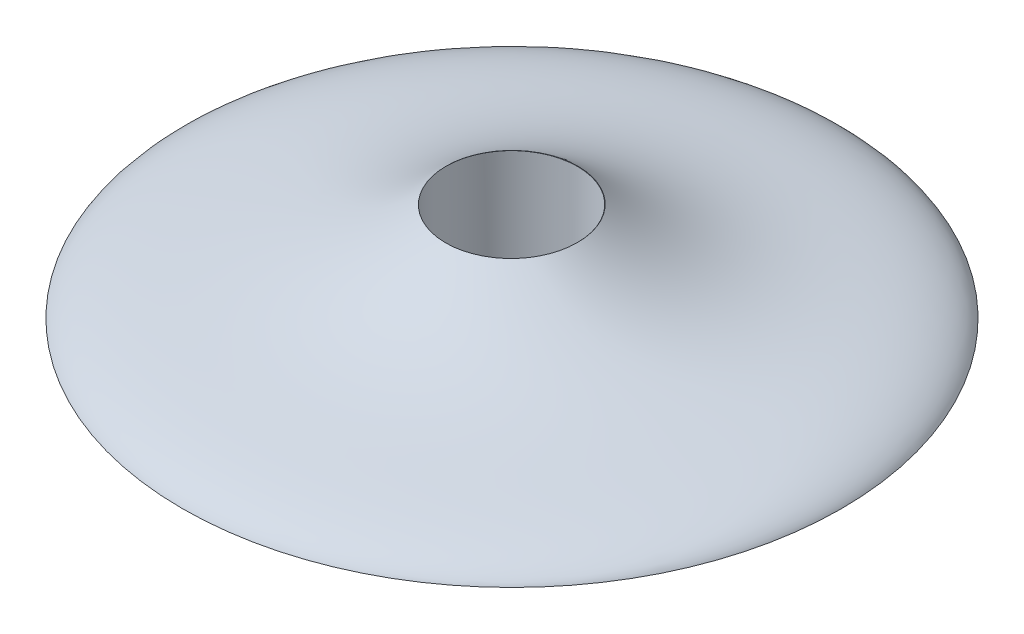
ISO-10303-21;
HEADER;
FILE_DESCRIPTION(('STEP AP214'),'2;1');
FILE_NAME('part.step','',(''),(''),'','','');
FILE_SCHEMA(('AUTOMOTIVE_DESIGN { 1 0 10303 214 1 1 1 1 }'));
ENDSEC;
DATA;
#1=APPLICATION_CONTEXT('core data for automotive mechanical design processes');
#2=APPLICATION_PROTOCOL_DEFINITION('international standard','automotive_design',2000,#1);
#3=PRODUCT_CONTEXT('',#1,'mechanical');
#4=PRODUCT('Part','Part','',(#3));
#5=PRODUCT_RELATED_PRODUCT_CATEGORY('part','',(#4));
#6=PRODUCT_DEFINITION_FORMATION('','',#4);
#7=PRODUCT_DEFINITION_CONTEXT('part definition',#1,'design');
#8=PRODUCT_DEFINITION('design','',#6,#7);
#9=PRODUCT_DEFINITION_SHAPE('','',#8);
#10=(LENGTH_UNIT() NAMED_UNIT(*) SI_UNIT(.MILLI.,.METRE.));
#11=(NAMED_UNIT(*) PLANE_ANGLE_UNIT() SI_UNIT($,.RADIAN.));
#12=(NAMED_UNIT(*) SI_UNIT($,.STERADIAN.) SOLID_ANGLE_UNIT());
#13=UNCERTAINTY_MEASURE_WITH_UNIT(LENGTH_MEASURE(1.E-05),#10,'distance_accuracy_value','');
#14=(GEOMETRIC_REPRESENTATION_CONTEXT(3) GLOBAL_UNCERTAINTY_ASSIGNED_CONTEXT((#13)) GLOBAL_UNIT_ASSIGNED_CONTEXT((#10,
#11,#12)) REPRESENTATION_CONTEXT('',''));
#15=CARTESIAN_POINT('',(0.,0.,0.));
#16=DIRECTION('',(0.,0.,1.));
#17=DIRECTION('',(1.,0.,0.));
#18=AXIS2_PLACEMENT_3D('',#15,#16,#17);
#19=CARTESIAN_POINT('',(0.,21.8997437807607,77.0266387212866));
#20=DIRECTION('',(0.,-1.,0.));
#21=DIRECTION('',(0.,0.,-1.));
#22=AXIS2_PLACEMENT_3D('',#19,#20,#21);
#23=PLANE('',#22);
#24=CARTESIAN_POINT('',(0.,21.8997437807607,77.0266387212866));
#25=DIRECTION('',(0.,1.,0.));
#26=DIRECTION('',(0.,0.,1.));
#27=AXIS2_PLACEMENT_3D('',#24,#25,#26);
#28=CIRCLE('',#27,20.);
#29=CARTESIAN_POINT('',(19.9999011276975,21.8997437807607,77.0895265764357));
#30=VERTEX_POINT('',#29);
#31=CARTESIAN_POINT('',(-19.9999011276975,21.8997437807607,77.0895265764357));
#32=VERTEX_POINT('',#31);
#33=EDGE_CURVE('E11',#30,#32,#28,.T.);
#34=ORIENTED_EDGE('',*,*,#33,.T.);
#35=CARTESIAN_POINT('',(0.,21.8997437807607,77.1524144315848));
#36=DIRECTION('',(0.,1.,0.));
#37=DIRECTION('',(0.,0.,1.));
#38=AXIS2_PLACEMENT_3D('',#35,#36,#37);
#39=CIRCLE('',#38,20.);
#40=EDGE_CURVE('E53',#30,#32,#39,.T.);
#41=ORIENTED_EDGE('',*,*,#40,.F.);
#42=EDGE_LOOP('',(#34,#41));
#43=FACE_BOUND('',#42,.T.);
#44=ADVANCED_FACE('F38',(#43),#23,.F.);
#45=CARTESIAN_POINT('',(0.,-8.10025621923931,-22.9733612787134));
#46=CARTESIAN_POINT('',(0.,-2.49334702214268,-19.9993093597715));
#47=CARTESIAN_POINT('',(0.,5.04834585964005,0.0220774557360062));
#48=CARTESIAN_POINT('',(0.,-4.11511832897066,26.4374090590696));
#49=CARTESIAN_POINT('',(0.,21.8997437807607,57.0266387212866));
#50=B_SPLINE_CURVE_WITH_KNOTS('',4,(#45,#46,#47,#48,#49),.UNSPECIFIED.,.F.,.F.,(5,5),(0.,1.),.UNSPECIFIED.);
#51=CARTESIAN_POINT('',(0.,21.8997437807607,77.0266387212866));
#52=DIRECTION('',(0.,1.,0.));
#53=AXIS1_PLACEMENT('',#51,#52);
#54=SURFACE_OF_REVOLUTION('',#50,#53);
#55=ORIENTED_EDGE('',*,*,#33,.F.);
#56=CARTESIAN_POINT('',(19.9999011276975,21.8997437807607,77.0895265764357));
#57=CARTESIAN_POINT('',(20.001092221049,21.8977381002619,77.4645352176946));
#58=CARTESIAN_POINT('',(19.9917125112781,21.8957328209817,77.8395757495852));
#59=CARTESIAN_POINT('',(19.9518944773006,21.8917294683275,78.5885196430176));
#60=CARTESIAN_POINT('',(19.9214571506898,21.8897313946167,78.9624230575871));
#61=CARTESIAN_POINT('',(19.8396076463942,21.8857486981624,79.7079213766596));
#62=CARTESIAN_POINT('',(19.7881958143085,21.8837640751978,80.0795163190969));
#63=CARTESIAN_POINT('',(19.6646075361611,21.8798158811614,80.8189691824129));
#64=CARTESIAN_POINT('',(19.5924455892104,21.8778522963795,81.1868295276564));
#65=CARTESIAN_POINT('',(19.4275679732304,21.8739509270405,81.9179164707618));
#66=CARTESIAN_POINT('',(19.3348525218015,21.8720131422105,82.2811431176377));
#67=CARTESIAN_POINT('',(19.1291714769108,21.868169561009,83.0017938624247));
#68=CARTESIAN_POINT('',(19.0162059975258,21.8662637644574,83.3592179930115));
#69=CARTESIAN_POINT('',(18.7088321108513,21.8615454314083,84.2443547145617));
#70=CARTESIAN_POINT('',(18.5019550705119,21.8587563370948,84.7677875050585));
#71=CARTESIAN_POINT('',(18.0447863708337,21.8532825732262,85.7954450318985));
#72=CARTESIAN_POINT('',(17.7944889975793,21.8505979174717,86.2996672295521));
#73=CARTESIAN_POINT('',(17.3879386931329,21.8466644521363,87.0387031283518));
#74=CARTESIAN_POINT('',(17.247229856479,21.8453688192494,87.2821775919297));
#75=CARTESIAN_POINT('',(16.955717515653,21.8428110814062,87.7629114206017));
#76=CARTESIAN_POINT('',(16.8049168662983,21.8415489671079,88.0001725171585));
#77=CARTESIAN_POINT('',(16.3376748344457,21.8378154624813,88.7021443564265));
#78=CARTESIAN_POINT('',(16.0063699999392,21.8353966844077,89.1570861154119));
#79=CARTESIAN_POINT('',(15.3066515586973,21.8307178716937,90.0373928230833));
#80=CARTESIAN_POINT('',(14.9382373172041,21.8284578397698,90.4627572656379));
#81=CARTESIAN_POINT('',(14.1668744703041,21.8241118849045,91.2809576506586));
#82=CARTESIAN_POINT('',(13.7639258042507,21.822025962269,91.673793535998));
#83=CARTESIAN_POINT('',(12.9263081834063,21.8180425510046,92.4241789964255));
#84=CARTESIAN_POINT('',(12.4916344206021,21.816145091041,92.7817232035806));
#85=CARTESIAN_POINT('',(11.5937081192713,21.8125521159803,93.4589205816631));
#86=CARTESIAN_POINT('',(11.1304555937526,21.8108566007912,93.7785737698366));
#87=CARTESIAN_POINT('',(10.17869385845,21.8076793734484,94.3776974499669));
#88=CARTESIAN_POINT('',(9.6901861008005,21.8061976490206,94.6571702487443));
#89=CARTESIAN_POINT('',(8.69136236998318,21.8034581471083,95.1739682428714));
#90=CARTESIAN_POINT('',(8.1810463957759,21.8022003696344,95.4112934362123));
#91=CARTESIAN_POINT('',(7.14226800043066,21.7999175366165,95.8420947482119));
#92=CARTESIAN_POINT('',(6.61380674557868,21.7988924661475,96.035573679032));
#93=CARTESIAN_POINT('',(5.54246365366026,21.7970820273592,96.3773263762169));
#94=CARTESIAN_POINT('',(4.99958181771242,21.7962966590214,96.5256001460884));
#95=CARTESIAN_POINT('',(3.90325256961784,21.7949710420738,96.7758893417012));
#96=CARTESIAN_POINT('',(3.34980507299221,21.7944307954248,96.8779043974142));
#97=CARTESIAN_POINT('',(2.23628331935799,21.7935991594462,97.0349491132034));
#98=CARTESIAN_POINT('',(1.6762090620425,21.7933077701281,97.0899787711034));
#99=CARTESIAN_POINT('',(0.553402565480072,21.7929758552332,97.152662150197));
#100=CARTESIAN_POINT('',(-0.00932973491369487,21.7929353354561,97.1603147761433));
#101=CARTESIAN_POINT('',(-1.13343861168034,21.7931054546382,97.1281867610819));
#102=CARTESIAN_POINT('',(-1.69481518805403,21.7933160935973,97.0884061201028));
#103=CARTESIAN_POINT('',(-2.81221261566779,21.7939870717926,96.9616954226768));
#104=CARTESIAN_POINT('',(-3.36823355113122,21.7944474070955,96.874766108931));
#105=CARTESIAN_POINT('',(-4.47097569012444,21.7956145989238,96.654376622958));
#106=CARTESIAN_POINT('',(-5.01769689375709,21.7963214554465,96.5209164512454));
#107=CARTESIAN_POINT('',(-6.09795053839222,21.7979768063493,96.2084147790877));
#108=CARTESIAN_POINT('',(-6.63148303286618,21.7989252997495,96.0293734634771));
#109=CARTESIAN_POINT('',(-7.68156850600319,21.8010573730238,95.6269822178249));
#110=CARTESIAN_POINT('',(-8.19812148547225,21.8022409528867,95.4036322898866));
#111=CARTESIAN_POINT('',(-9.21058942057427,21.8048350502629,94.9142051200556));
#112=CARTESIAN_POINT('',(-9.70650381693025,21.8062455739209,94.6481267212286));
#113=CARTESIAN_POINT('',(-10.674154165707,21.8092837714451,94.0751387739956));
#114=CARTESIAN_POINT('',(-11.1458901090927,21.8109114453925,93.7682292103319));
#115=CARTESIAN_POINT('',(-12.0618095264709,21.8143725863459,93.1157751738089));
#116=CARTESIAN_POINT('',(-12.5059942186257,21.8162060442433,92.7702324109895));
#117=CARTESIAN_POINT('',(-13.3636746808826,21.8200660735655,92.0429597486565));
#118=CARTESIAN_POINT('',(-13.7771705066755,21.82209264464,91.6612299148143));
#119=CARTESIAN_POINT('',(-14.5704902546924,21.8263245911526,90.8643382967005));
#120=CARTESIAN_POINT('',(-14.950318211399,21.8285299451061,90.4491805295686));
#121=CARTESIAN_POINT('',(-15.6736494945985,21.8331042110875,89.5883629580386));
#122=CARTESIAN_POINT('',(-16.0171525562319,21.8354731243078,89.1427029312753));
#123=CARTESIAN_POINT('',(-16.6655345918439,21.8403591704009,88.2238249314014));
#124=CARTESIAN_POINT('',(-16.9704014939699,21.8428763492411,87.7505984122339));
#125=CARTESIAN_POINT('',(-17.3969003417607,21.8467484223055,87.0229250477528));
#126=CARTESIAN_POINT('',(-17.5339369357995,21.8480552075236,86.7773868456135));
#127=CARTESIAN_POINT('',(-17.797575307058,21.8506991977262,86.2806882068274));
#128=CARTESIAN_POINT('',(-17.9241743880934,21.8520364104576,86.0295263386665));
#129=CARTESIAN_POINT('',(-18.2880111264756,21.8560908671448,85.2681449357034));
#130=CARTESIAN_POINT('',(-18.5092127557612,21.858850243814,84.7501584865613));
#131=CARTESIAN_POINT('',(-18.9071439354522,21.8644607770504,83.6973805820769));
#132=CARTESIAN_POINT('',(-19.0838737272239,21.8673119331193,83.1625892179593));
#133=CARTESIAN_POINT('',(-19.3145784313741,21.8716401618842,82.3510777068221));
#134=CARTESIAN_POINT('',(-19.3857243693586,21.8730908317842,82.0791425896372));
#135=CARTESIAN_POINT('',(-19.5164809754773,21.8760070932631,81.532587976357));
#136=CARTESIAN_POINT('',(-19.5760943934245,21.8774726811971,81.2579691366146));
#137=CARTESIAN_POINT('',(-19.7374467042987,21.8818875018377,80.4309017137122));
#138=CARTESIAN_POINT('',(-19.821787006058,21.8848564684426,79.8749277827698));
#139=CARTESIAN_POINT('',(-19.9228511934919,21.8898165740638,78.9464823799238));
#140=CARTESIAN_POINT('',(-19.9527867630622,21.8917997347471,78.5753724681061));
#141=CARTESIAN_POINT('',(-19.9918799961091,21.8957696312209,77.8326914965763));
#142=CARTESIAN_POINT('',(-20.0010728321094,21.897756355234,77.4611222880433));
#143=CARTESIAN_POINT('',(-19.9999011276975,21.8997437807607,77.089526576436));
#144=B_SPLINE_CURVE_WITH_KNOTS('',3,(#56,#57,#58,#59,#60,#61,#62,#63,#64,#65,#66,#67,#68,#69,
#70,#71,#72,#73,#74,#75,#76,#77,#78,#79,#80,#81,#82,#83,#84,#85,#86,#87,#88,#89,#90,#91,#92,#93,
#94,#95,#96,#97,#98,#99,#100,#101,#102,#103,#104,#105,#106,#107,#108,#109,#110,#111,#112,#113,
#114,#115,#116,#117,#118,#119,#120,#121,#122,#123,#124,#125,#126,#127,#128,#129,#130,#131,#132,
#133,#134,#135,#136,#137,#138,#139,#140,#141,#142,#143),.UNSPECIFIED.,.F.,.F.,(4,2,2,2,2,2,2,2,
2,2,2,2,2,2,2,2,2,2,2,2,2,2,2,2,2,2,2,2,2,2,2,2,2,2,2,2,2,2,2,2,2,2,2,4),(0.,1.12489704133022,
2.24974079476906,3.37456601479253,4.49860716693185,5.62263641939044,6.7466593399231,
8.43310186497809,10.1197664866762,10.9631854597512,11.8063668430515,13.4925846602294,
15.178831325122,16.8650809513342,18.5515866654399,20.2380916119272,21.9244996947663,
23.6109078579833,25.2972078296577,26.9835076705275,28.6698210000453,30.3561344076621,
32.0424867987898,33.7288391889037,35.4151650158241,37.1014908240917,38.7878097943007,
40.4741286844596,42.1604932418058,43.846858429312,45.5331490019504,47.2194365144167,
48.9055216820073,50.5916191426822,52.2782421317495,53.1216076504323,53.9651903463758,
55.6528024303279,57.3404053547397,58.1834585672982,59.0263105138922,60.7110367597443,
61.8274778597521,62.9420244334169),.UNSPECIFIED.);
#145=EDGE_CURVE('E55',#30,#32,#144,.T.);
#146=ORIENTED_EDGE('',*,*,#145,.T.);
#147=EDGE_LOOP('',(#55,#146));
#148=FACE_BOUND('',#147,.T.);
#149=CARTESIAN_POINT('',(0.,-8.10025621923931,77.0266387212866));
#150=DIRECTION('',(0.,1.,0.));
#151=DIRECTION('',(0.,0.,1.));
#152=AXIS2_PLACEMENT_3D('',#149,#150,#151);
#153=CIRCLE('',#152,100.);
#154=CARTESIAN_POINT('',(0.,-8.10025621923931,177.026638721287));
#155=VERTEX_POINT('',#154);
#156=EDGE_CURVE('E47',#155,#155,#153,.T.);
#157=ORIENTED_EDGE('',*,*,#156,.T.);
#158=EDGE_LOOP('',(#157));
#159=FACE_BOUND('',#158,.T.);
#160=ADVANCED_FACE('F64',(#148,#159),#54,.T.);
#161=CARTESIAN_POINT('',(0.,-8.10025621923931,77.0266387212866));
#162=DIRECTION('',(0.,1.,0.));
#163=DIRECTION('',(0.,0.,1.));
#164=AXIS2_PLACEMENT_3D('',#161,#162,#163);
#165=PLANE('',#164);
#166=CARTESIAN_POINT('',(0.,-8.10025621923931,77.1524144315848));
#167=DIRECTION('',(0.,1.,0.));
#168=DIRECTION('',(0.,0.,1.));
#169=AXIS2_PLACEMENT_3D('',#166,#167,#168);
#170=CIRCLE('',#169,20.);
#171=CARTESIAN_POINT('',(0.,-8.10025621923931,97.1524144315848));
#172=VERTEX_POINT('',#171);
#173=EDGE_CURVE('E41',#172,#172,#170,.T.);
#174=ORIENTED_EDGE('',*,*,#173,.T.);
#175=EDGE_LOOP('',(#174));
#176=FACE_BOUND('',#175,.T.);
#177=ORIENTED_EDGE('',*,*,#156,.F.);
#178=EDGE_LOOP('',(#177));
#179=FACE_BOUND('',#178,.T.);
#180=ADVANCED_FACE('F67',(#176,#179),#165,.F.);
#181=CARTESIAN_POINT('',(0.,-36.1002562192393,77.1524144315848));
#182=DIRECTION('',(0.,1.,0.));
#183=DIRECTION('',(0.,0.,1.));
#184=AXIS2_PLACEMENT_3D('',#181,#182,#183);
#185=CYLINDRICAL_SURFACE('',#184,20.);
#186=ORIENTED_EDGE('',*,*,#173,.F.);
#187=EDGE_LOOP('',(#186));
#188=FACE_BOUND('',#187,.T.);
#189=ORIENTED_EDGE('',*,*,#40,.T.);
#190=ORIENTED_EDGE('',*,*,#145,.F.);
#191=EDGE_LOOP('',(#189,#190));
#192=FACE_BOUND('',#191,.T.);
#193=ADVANCED_FACE('F56',(#188,#192),#185,.F.);
#194=CLOSED_SHELL('',(#44,#160,#180,#193));
#195=MANIFOLD_SOLID_BREP('B2',#194);
#196=ADVANCED_BREP_SHAPE_REPRESENTATION('',(#18,#195),#14);
#197=SHAPE_DEFINITION_REPRESENTATION(#9,#196);
ENDSEC;
END-ISO-10303-21;
